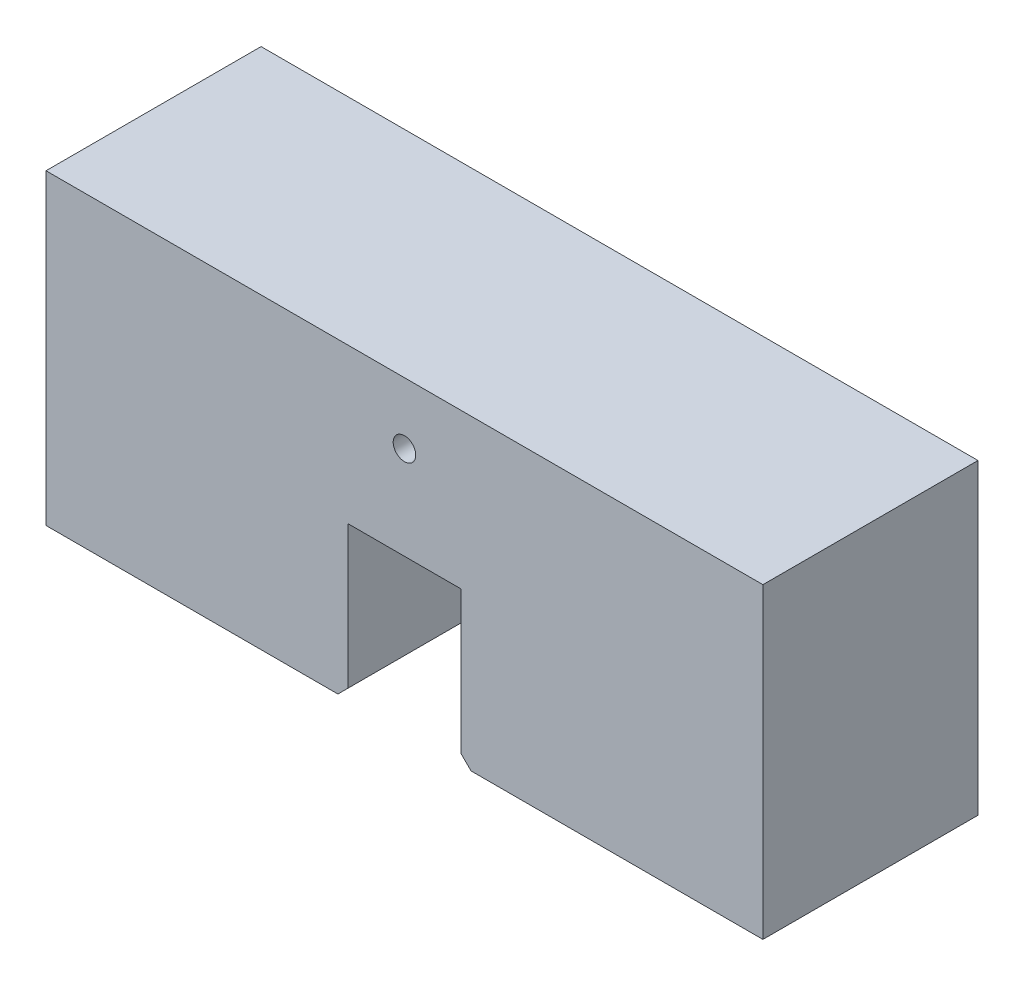
ISO-10303-21;
HEADER;
FILE_DESCRIPTION(('STEP AP214'),'2;1');
FILE_NAME('part.step','',(''),(''),'','','');
FILE_SCHEMA(('AUTOMOTIVE_DESIGN { 1 0 10303 214 1 1 1 1 }'));
ENDSEC;
DATA;
#1=APPLICATION_CONTEXT('core data for automotive mechanical design processes');
#2=APPLICATION_PROTOCOL_DEFINITION('international standard','automotive_design',2000,#1);
#3=PRODUCT_CONTEXT('',#1,'mechanical');
#4=PRODUCT('Part','Part','',(#3));
#5=PRODUCT_RELATED_PRODUCT_CATEGORY('part','',(#4));
#6=PRODUCT_DEFINITION_FORMATION('','',#4);
#7=PRODUCT_DEFINITION_CONTEXT('part definition',#1,'design');
#8=PRODUCT_DEFINITION('design','',#6,#7);
#9=PRODUCT_DEFINITION_SHAPE('','',#8);
#10=(LENGTH_UNIT() NAMED_UNIT(*) SI_UNIT(.MILLI.,.METRE.));
#11=(NAMED_UNIT(*) PLANE_ANGLE_UNIT() SI_UNIT($,.RADIAN.));
#12=(NAMED_UNIT(*) SI_UNIT($,.STERADIAN.) SOLID_ANGLE_UNIT());
#13=UNCERTAINTY_MEASURE_WITH_UNIT(LENGTH_MEASURE(1.E-05),#10,'distance_accuracy_value','');
#14=(GEOMETRIC_REPRESENTATION_CONTEXT(3) GLOBAL_UNCERTAINTY_ASSIGNED_CONTEXT((#13)) GLOBAL_UNIT_ASSIGNED_CONTEXT((#10,
#11,#12)) REPRESENTATION_CONTEXT('',''));
#15=CARTESIAN_POINT('',(0.,0.,0.));
#16=DIRECTION('',(0.,0.,1.));
#17=DIRECTION('',(1.,0.,0.));
#18=AXIS2_PLACEMENT_3D('',#15,#16,#17);
#19=CARTESIAN_POINT('',(-350.,232.421392473446,105.));
#20=DIRECTION('',(1.,0.,0.));
#21=DIRECTION('',(0.,1.,0.));
#22=AXIS2_PLACEMENT_3D('',#19,#20,#21);
#23=PLANE('',#22);
#24=DIRECTION('',(0.,-1.,0.));
#25=VECTOR('',#24,1.);
#26=CARTESIAN_POINT('',(-350.,232.421392473446,-105.));
#27=LINE('',#26,#25);
#28=CARTESIAN_POINT('',(-350.,232.421392473446,-105.));
#29=VERTEX_POINT('',#28);
#30=CARTESIAN_POINT('',(-350.,-67.5786075265541,-105.));
#31=VERTEX_POINT('',#30);
#32=EDGE_CURVE('E150',#29,#31,#27,.T.);
#33=ORIENTED_EDGE('',*,*,#32,.T.);
#34=DIRECTION('',(0.,0.,-1.));
#35=VECTOR('',#34,1.);
#36=CARTESIAN_POINT('',(-350.,-67.5786075265541,105.));
#37=LINE('',#36,#35);
#38=CARTESIAN_POINT('',(-350.,-67.5786075265541,105.));
#39=VERTEX_POINT('',#38);
#40=EDGE_CURVE('E11',#39,#31,#37,.T.);
#41=ORIENTED_EDGE('',*,*,#40,.F.);
#42=DIRECTION('',(0.,-1.,0.));
#43=VECTOR('',#42,1.);
#44=CARTESIAN_POINT('',(-350.,232.421392473446,105.));
#45=LINE('',#44,#43);
#46=CARTESIAN_POINT('',(-350.,232.421392473446,105.));
#47=VERTEX_POINT('',#46);
#48=EDGE_CURVE('E167',#47,#39,#45,.T.);
#49=ORIENTED_EDGE('',*,*,#48,.F.);
#50=DIRECTION('',(0.,0.,-1.));
#51=VECTOR('',#50,1.);
#52=CARTESIAN_POINT('',(-350.,232.421392473446,105.));
#53=LINE('',#52,#51);
#54=EDGE_CURVE('E141',#47,#29,#53,.T.);
#55=ORIENTED_EDGE('',*,*,#54,.T.);
#56=EDGE_LOOP('',(#33,#41,#49,#55));
#57=FACE_BOUND('',#56,.T.);
#58=ADVANCED_FACE('F39',(#57),#23,.F.);
#59=CARTESIAN_POINT('',(-350.,-67.5786075265541,105.));
#60=DIRECTION('',(0.,1.,0.));
#61=DIRECTION('',(-1.,0.,0.));
#62=AXIS2_PLACEMENT_3D('',#59,#60,#61);
#63=PLANE('',#62);
#64=DIRECTION('',(1.,0.,0.));
#65=VECTOR('',#64,1.);
#66=CARTESIAN_POINT('',(-350.,-67.5786075265541,-105.));
#67=LINE('',#66,#65);
#68=CARTESIAN_POINT('',(-65.,-67.5786075265541,-105.));
#69=VERTEX_POINT('',#68);
#70=EDGE_CURVE('E147',#31,#69,#67,.T.);
#71=ORIENTED_EDGE('',*,*,#70,.T.);
#72=DIRECTION('',(0.,0.,-1.));
#73=VECTOR('',#72,1.);
#74=CARTESIAN_POINT('',(-65.,-67.5786075265541,105.));
#75=LINE('',#74,#73);
#76=CARTESIAN_POINT('',(-65.,-67.5786075265541,105.));
#77=VERTEX_POINT('',#76);
#78=EDGE_CURVE('E50',#77,#69,#75,.T.);
#79=ORIENTED_EDGE('',*,*,#78,.F.);
#80=DIRECTION('',(1.,0.,0.));
#81=VECTOR('',#80,1.);
#82=CARTESIAN_POINT('',(-350.,-67.5786075265541,105.));
#83=LINE('',#82,#81);
#84=EDGE_CURVE('E102',#39,#77,#83,.T.);
#85=ORIENTED_EDGE('',*,*,#84,.F.);
#86=ORIENTED_EDGE('',*,*,#40,.T.);
#87=EDGE_LOOP('',(#71,#79,#85,#86));
#88=FACE_BOUND('',#87,.T.);
#89=ADVANCED_FACE('F231',(#88),#63,.F.);
#90=CARTESIAN_POINT('',(-65.,-67.5786075265541,105.));
#91=DIRECTION('',(-0.707106781186546,0.707106781186549,0.));
#92=DIRECTION('',(-0.707106781186549,-0.707106781186546,0.));
#93=AXIS2_PLACEMENT_3D('',#90,#91,#92);
#94=PLANE('',#93);
#95=DIRECTION('',(0.707106781186549,0.707106781186546,0.));
#96=VECTOR('',#95,1.);
#97=CARTESIAN_POINT('',(-65.,-67.5786075265541,-105.));
#98=LINE('',#97,#96);
#99=CARTESIAN_POINT('',(-55.,-57.5786075265541,-105.));
#100=VERTEX_POINT('',#99);
#101=EDGE_CURVE('E153',#69,#100,#98,.T.);
#102=ORIENTED_EDGE('',*,*,#101,.T.);
#103=DIRECTION('',(0.,0.,-1.));
#104=VECTOR('',#103,1.);
#105=CARTESIAN_POINT('',(-55.,-57.5786075265541,105.));
#106=LINE('',#105,#104);
#107=CARTESIAN_POINT('',(-55.,-57.5786075265541,105.));
#108=VERTEX_POINT('',#107);
#109=EDGE_CURVE('E177',#108,#100,#106,.T.);
#110=ORIENTED_EDGE('',*,*,#109,.F.);
#111=DIRECTION('',(0.707106781186549,0.707106781186546,0.));
#112=VECTOR('',#111,1.);
#113=CARTESIAN_POINT('',(-65.,-67.5786075265541,105.));
#114=LINE('',#113,#112);
#115=EDGE_CURVE('E189',#77,#108,#114,.T.);
#116=ORIENTED_EDGE('',*,*,#115,.F.);
#117=ORIENTED_EDGE('',*,*,#78,.T.);
#118=EDGE_LOOP('',(#102,#110,#116,#117));
#119=FACE_BOUND('',#118,.T.);
#120=ADVANCED_FACE('F183',(#119),#94,.F.);
#121=CARTESIAN_POINT('',(-55.,-57.5786075265541,105.));
#122=DIRECTION('',(-1.,0.,0.));
#123=DIRECTION('',(0.,0.,1.));
#124=AXIS2_PLACEMENT_3D('',#121,#122,#123);
#125=PLANE('',#124);
#126=DIRECTION('',(0.,1.,0.));
#127=VECTOR('',#126,1.);
#128=CARTESIAN_POINT('',(-55.,-57.5786075265541,-105.));
#129=LINE('',#128,#127);
#130=CARTESIAN_POINT('',(-55.,81.4213924734459,-105.));
#131=VERTEX_POINT('',#130);
#132=EDGE_CURVE('E154',#100,#131,#129,.T.);
#133=ORIENTED_EDGE('',*,*,#132,.T.);
#134=DIRECTION('',(0.,0.,-1.));
#135=VECTOR('',#134,1.);
#136=CARTESIAN_POINT('',(-55.,81.4213924734459,105.));
#137=LINE('',#136,#135);
#138=CARTESIAN_POINT('',(-55.,81.4213924734459,105.));
#139=VERTEX_POINT('',#138);
#140=EDGE_CURVE('E178',#139,#131,#137,.T.);
#141=ORIENTED_EDGE('',*,*,#140,.F.);
#142=DIRECTION('',(0.,1.,0.));
#143=VECTOR('',#142,1.);
#144=CARTESIAN_POINT('',(-55.,-57.5786075265541,105.));
#145=LINE('',#144,#143);
#146=EDGE_CURVE('E202',#108,#139,#145,.T.);
#147=ORIENTED_EDGE('',*,*,#146,.F.);
#148=ORIENTED_EDGE('',*,*,#109,.T.);
#149=EDGE_LOOP('',(#133,#141,#147,#148));
#150=FACE_BOUND('',#149,.T.);
#151=ADVANCED_FACE('F198',(#150),#125,.F.);
#152=CARTESIAN_POINT('',(-55.,81.4213924734459,105.));
#153=DIRECTION('',(0.,1.,0.));
#154=DIRECTION('',(0.,0.,1.));
#155=AXIS2_PLACEMENT_3D('',#152,#153,#154);
#156=PLANE('',#155);
#157=DIRECTION('',(1.,0.,0.));
#158=VECTOR('',#157,1.);
#159=CARTESIAN_POINT('',(-55.,81.4213924734459,-105.));
#160=LINE('',#159,#158);
#161=CARTESIAN_POINT('',(55.,81.4213924734459,-105.));
#162=VERTEX_POINT('',#161);
#163=EDGE_CURVE('E160',#131,#162,#160,.T.);
#164=ORIENTED_EDGE('',*,*,#163,.T.);
#165=DIRECTION('',(0.,0.,-1.));
#166=VECTOR('',#165,1.);
#167=CARTESIAN_POINT('',(55.,81.4213924734459,105.));
#168=LINE('',#167,#166);
#169=CARTESIAN_POINT('',(55.,81.4213924734459,105.));
#170=VERTEX_POINT('',#169);
#171=EDGE_CURVE('E172',#170,#162,#168,.T.);
#172=ORIENTED_EDGE('',*,*,#171,.F.);
#173=DIRECTION('',(1.,0.,0.));
#174=VECTOR('',#173,1.);
#175=CARTESIAN_POINT('',(-55.,81.4213924734459,105.));
#176=LINE('',#175,#174);
#177=EDGE_CURVE('E205',#139,#170,#176,.T.);
#178=ORIENTED_EDGE('',*,*,#177,.F.);
#179=ORIENTED_EDGE('',*,*,#140,.T.);
#180=EDGE_LOOP('',(#164,#172,#178,#179));
#181=FACE_BOUND('',#180,.T.);
#182=ADVANCED_FACE('F199',(#181),#156,.F.);
#183=CARTESIAN_POINT('',(55.,-57.5786075265541,105.));
#184=DIRECTION('',(1.,0.,0.));
#185=DIRECTION('',(0.,1.,0.));
#186=AXIS2_PLACEMENT_3D('',#183,#184,#185);
#187=PLANE('',#186);
#188=DIRECTION('',(0.,-1.,0.));
#189=VECTOR('',#188,1.);
#190=CARTESIAN_POINT('',(55.,-57.5786075265541,-105.));
#191=LINE('',#190,#189);
#192=CARTESIAN_POINT('',(55.,-57.5786075265541,-105.));
#193=VERTEX_POINT('',#192);
#194=EDGE_CURVE('E157',#162,#193,#191,.T.);
#195=ORIENTED_EDGE('',*,*,#194,.T.);
#196=DIRECTION('',(0.,0.,-1.));
#197=VECTOR('',#196,1.);
#198=CARTESIAN_POINT('',(55.,-57.5786075265541,105.));
#199=LINE('',#198,#197);
#200=CARTESIAN_POINT('',(55.,-57.5786075265541,105.));
#201=VERTEX_POINT('',#200);
#202=EDGE_CURVE('E168',#201,#193,#199,.T.);
#203=ORIENTED_EDGE('',*,*,#202,.F.);
#204=DIRECTION('',(0.,-1.,0.));
#205=VECTOR('',#204,1.);
#206=CARTESIAN_POINT('',(55.,-57.5786075265541,105.));
#207=LINE('',#206,#205);
#208=EDGE_CURVE('E204',#170,#201,#207,.T.);
#209=ORIENTED_EDGE('',*,*,#208,.F.);
#210=ORIENTED_EDGE('',*,*,#171,.T.);
#211=EDGE_LOOP('',(#195,#203,#209,#210));
#212=FACE_BOUND('',#211,.T.);
#213=ADVANCED_FACE('F241',(#212),#187,.F.);
#214=CARTESIAN_POINT('',(65.,-67.5786075265541,105.));
#215=DIRECTION('',(0.707106781186546,0.707106781186549,0.));
#216=DIRECTION('',(-0.707106781186549,0.707106781186546,0.));
#217=AXIS2_PLACEMENT_3D('',#214,#215,#216);
#218=PLANE('',#217);
#219=DIRECTION('',(0.707106781186549,-0.707106781186546,0.));
#220=VECTOR('',#219,1.);
#221=CARTESIAN_POINT('',(65.,-67.5786075265541,-105.));
#222=LINE('',#221,#220);
#223=CARTESIAN_POINT('',(65.,-67.5786075265541,-105.));
#224=VERTEX_POINT('',#223);
#225=EDGE_CURVE('E161',#193,#224,#222,.T.);
#226=ORIENTED_EDGE('',*,*,#225,.T.);
#227=DIRECTION('',(0.,0.,-1.));
#228=VECTOR('',#227,1.);
#229=CARTESIAN_POINT('',(65.,-67.5786075265541,105.));
#230=LINE('',#229,#228);
#231=CARTESIAN_POINT('',(65.,-67.5786075265541,105.));
#232=VERTEX_POINT('',#231);
#233=EDGE_CURVE('E136',#232,#224,#230,.T.);
#234=ORIENTED_EDGE('',*,*,#233,.F.);
#235=DIRECTION('',(0.707106781186549,-0.707106781186546,0.));
#236=VECTOR('',#235,1.);
#237=CARTESIAN_POINT('',(65.,-67.5786075265541,105.));
#238=LINE('',#237,#236);
#239=EDGE_CURVE('E129',#201,#232,#238,.T.);
#240=ORIENTED_EDGE('',*,*,#239,.F.);
#241=ORIENTED_EDGE('',*,*,#202,.T.);
#242=EDGE_LOOP('',(#226,#234,#240,#241));
#243=FACE_BOUND('',#242,.T.);
#244=ADVANCED_FACE('F244',(#243),#218,.F.);
#245=CARTESIAN_POINT('',(350.,-67.5786075265541,105.));
#246=DIRECTION('',(0.,1.,0.));
#247=DIRECTION('',(0.,0.,1.));
#248=AXIS2_PLACEMENT_3D('',#245,#246,#247);
#249=PLANE('',#248);
#250=DIRECTION('',(1.,0.,0.));
#251=VECTOR('',#250,1.);
#252=CARTESIAN_POINT('',(350.,-67.5786075265541,-105.));
#253=LINE('',#252,#251);
#254=CARTESIAN_POINT('',(350.,-67.5786075265541,-105.));
#255=VERTEX_POINT('',#254);
#256=EDGE_CURVE('E140',#224,#255,#253,.T.);
#257=ORIENTED_EDGE('',*,*,#256,.T.);
#258=DIRECTION('',(0.,0.,-1.));
#259=VECTOR('',#258,1.);
#260=CARTESIAN_POINT('',(350.,-67.5786075265541,105.));
#261=LINE('',#260,#259);
#262=CARTESIAN_POINT('',(350.,-67.5786075265541,105.));
#263=VERTEX_POINT('',#262);
#264=EDGE_CURVE('E135',#263,#255,#261,.T.);
#265=ORIENTED_EDGE('',*,*,#264,.F.);
#266=DIRECTION('',(1.,0.,0.));
#267=VECTOR('',#266,1.);
#268=CARTESIAN_POINT('',(350.,-67.5786075265541,105.));
#269=LINE('',#268,#267);
#270=EDGE_CURVE('E121',#232,#263,#269,.T.);
#271=ORIENTED_EDGE('',*,*,#270,.F.);
#272=ORIENTED_EDGE('',*,*,#233,.T.);
#273=EDGE_LOOP('',(#257,#265,#271,#272));
#274=FACE_BOUND('',#273,.T.);
#275=ADVANCED_FACE('F131',(#274),#249,.F.);
#276=CARTESIAN_POINT('',(350.,232.421392473446,105.));
#277=DIRECTION('',(-1.,0.,0.));
#278=DIRECTION('',(0.,-1.,0.));
#279=AXIS2_PLACEMENT_3D('',#276,#277,#278);
#280=PLANE('',#279);
#281=DIRECTION('',(0.,1.,0.));
#282=VECTOR('',#281,1.);
#283=CARTESIAN_POINT('',(350.,232.421392473446,-105.));
#284=LINE('',#283,#282);
#285=CARTESIAN_POINT('',(350.,232.421392473446,-105.));
#286=VERTEX_POINT('',#285);
#287=EDGE_CURVE('E89',#255,#286,#284,.T.);
#288=ORIENTED_EDGE('',*,*,#287,.T.);
#289=DIRECTION('',(0.,0.,-1.));
#290=VECTOR('',#289,1.);
#291=CARTESIAN_POINT('',(350.,232.421392473446,105.));
#292=LINE('',#291,#290);
#293=CARTESIAN_POINT('',(350.,232.421392473446,105.));
#294=VERTEX_POINT('',#293);
#295=EDGE_CURVE('E137',#294,#286,#292,.T.);
#296=ORIENTED_EDGE('',*,*,#295,.F.);
#297=DIRECTION('',(0.,1.,0.));
#298=VECTOR('',#297,1.);
#299=CARTESIAN_POINT('',(350.,232.421392473446,105.));
#300=LINE('',#299,#298);
#301=EDGE_CURVE('E130',#263,#294,#300,.T.);
#302=ORIENTED_EDGE('',*,*,#301,.F.);
#303=ORIENTED_EDGE('',*,*,#264,.T.);
#304=EDGE_LOOP('',(#288,#296,#302,#303));
#305=FACE_BOUND('',#304,.T.);
#306=ADVANCED_FACE('F143',(#305),#280,.F.);
#307=CARTESIAN_POINT('',(350.,232.421392473446,105.));
#308=DIRECTION('',(0.,-1.,0.));
#309=DIRECTION('',(0.,0.,-1.));
#310=AXIS2_PLACEMENT_3D('',#307,#308,#309);
#311=PLANE('',#310);
#312=DIRECTION('',(-1.,0.,0.));
#313=VECTOR('',#312,1.);
#314=CARTESIAN_POINT('',(350.,232.421392473446,-105.));
#315=LINE('',#314,#313);
#316=EDGE_CURVE('E96',#286,#29,#315,.T.);
#317=ORIENTED_EDGE('',*,*,#316,.T.);
#318=ORIENTED_EDGE('',*,*,#54,.F.);
#319=DIRECTION('',(-1.,0.,0.));
#320=VECTOR('',#319,1.);
#321=CARTESIAN_POINT('',(350.,232.421392473446,105.));
#322=LINE('',#321,#320);
#323=EDGE_CURVE('E54',#294,#47,#322,.T.);
#324=ORIENTED_EDGE('',*,*,#323,.F.);
#325=ORIENTED_EDGE('',*,*,#295,.T.);
#326=EDGE_LOOP('',(#317,#318,#324,#325));
#327=FACE_BOUND('',#326,.T.);
#328=ADVANCED_FACE('F225',(#327),#311,.F.);
#329=CARTESIAN_POINT('',(0.,0.,105.));
#330=DIRECTION('',(0.,0.,1.));
#331=DIRECTION('',(1.,0.,0.));
#332=AXIS2_PLACEMENT_3D('',#329,#330,#331);
#333=PLANE('',#332);
#334=CARTESIAN_POINT('',(0.,172.421392473446,105.));
#335=DIRECTION('',(0.,0.,1.));
#336=DIRECTION('',(1.,0.,0.));
#337=AXIS2_PLACEMENT_3D('',#334,#335,#336);
#338=CIRCLE('',#337,11.);
#339=CARTESIAN_POINT('',(11.,172.421392473446,105.));
#340=VERTEX_POINT('',#339);
#341=EDGE_CURVE('E214',#340,#340,#338,.T.);
#342=ORIENTED_EDGE('',*,*,#341,.F.);
#343=EDGE_LOOP('',(#342));
#344=FACE_BOUND('',#343,.T.);
#345=ORIENTED_EDGE('',*,*,#48,.T.);
#346=ORIENTED_EDGE('',*,*,#84,.T.);
#347=ORIENTED_EDGE('',*,*,#115,.T.);
#348=ORIENTED_EDGE('',*,*,#146,.T.);
#349=ORIENTED_EDGE('',*,*,#177,.T.);
#350=ORIENTED_EDGE('',*,*,#208,.T.);
#351=ORIENTED_EDGE('',*,*,#239,.T.);
#352=ORIENTED_EDGE('',*,*,#270,.T.);
#353=ORIENTED_EDGE('',*,*,#301,.T.);
#354=ORIENTED_EDGE('',*,*,#323,.T.);
#355=EDGE_LOOP('',(#345,#346,#347,#348,#349,#350,#351,#352,#353,#354));
#356=FACE_BOUND('',#355,.T.);
#357=ADVANCED_FACE('F124',(#344,#356),#333,.T.);
#358=CARTESIAN_POINT('',(0.,0.,-105.));
#359=DIRECTION('',(0.,0.,1.));
#360=DIRECTION('',(1.,0.,0.));
#361=AXIS2_PLACEMENT_3D('',#358,#359,#360);
#362=PLANE('',#361);
#363=CARTESIAN_POINT('',(0.,172.421392473446,-105.));
#364=DIRECTION('',(0.,0.,1.));
#365=DIRECTION('',(1.,0.,0.));
#366=AXIS2_PLACEMENT_3D('',#363,#364,#365);
#367=CIRCLE('',#366,11.);
#368=CARTESIAN_POINT('',(11.,172.421392473446,-105.));
#369=VERTEX_POINT('',#368);
#370=EDGE_CURVE('E151',#369,#369,#367,.T.);
#371=ORIENTED_EDGE('',*,*,#370,.T.);
#372=EDGE_LOOP('',(#371));
#373=FACE_BOUND('',#372,.T.);
#374=ORIENTED_EDGE('',*,*,#32,.F.);
#375=ORIENTED_EDGE('',*,*,#316,.F.);
#376=ORIENTED_EDGE('',*,*,#287,.F.);
#377=ORIENTED_EDGE('',*,*,#256,.F.);
#378=ORIENTED_EDGE('',*,*,#225,.F.);
#379=ORIENTED_EDGE('',*,*,#194,.F.);
#380=ORIENTED_EDGE('',*,*,#163,.F.);
#381=ORIENTED_EDGE('',*,*,#132,.F.);
#382=ORIENTED_EDGE('',*,*,#101,.F.);
#383=ORIENTED_EDGE('',*,*,#70,.F.);
#384=EDGE_LOOP('',(#374,#375,#376,#377,#378,#379,#380,#381,#382,#383));
#385=FACE_BOUND('',#384,.T.);
#386=ADVANCED_FACE('F193',(#373,#385),#362,.F.);
#387=CARTESIAN_POINT('',(0.,172.421392473446,-105.));
#388=DIRECTION('',(0.,0.,1.));
#389=DIRECTION('',(1.,0.,0.));
#390=AXIS2_PLACEMENT_3D('',#387,#388,#389);
#391=CYLINDRICAL_SURFACE('',#390,11.);
#392=ORIENTED_EDGE('',*,*,#370,.F.);
#393=EDGE_LOOP('',(#392));
#394=FACE_BOUND('',#393,.T.);
#395=ORIENTED_EDGE('',*,*,#341,.T.);
#396=EDGE_LOOP('',(#395));
#397=FACE_BOUND('',#396,.T.);
#398=ADVANCED_FACE('F218',(#394,#397),#391,.F.);
#399=CLOSED_SHELL('',(#58,#89,#120,#151,#182,#213,#244,#275,#306,#328,#357,#386,#398));
#400=MANIFOLD_SOLID_BREP('B2',#399);
#401=ADVANCED_BREP_SHAPE_REPRESENTATION('',(#18,#400),#14);
#402=SHAPE_DEFINITION_REPRESENTATION(#9,#401);
ENDSEC;
END-ISO-10303-21;
